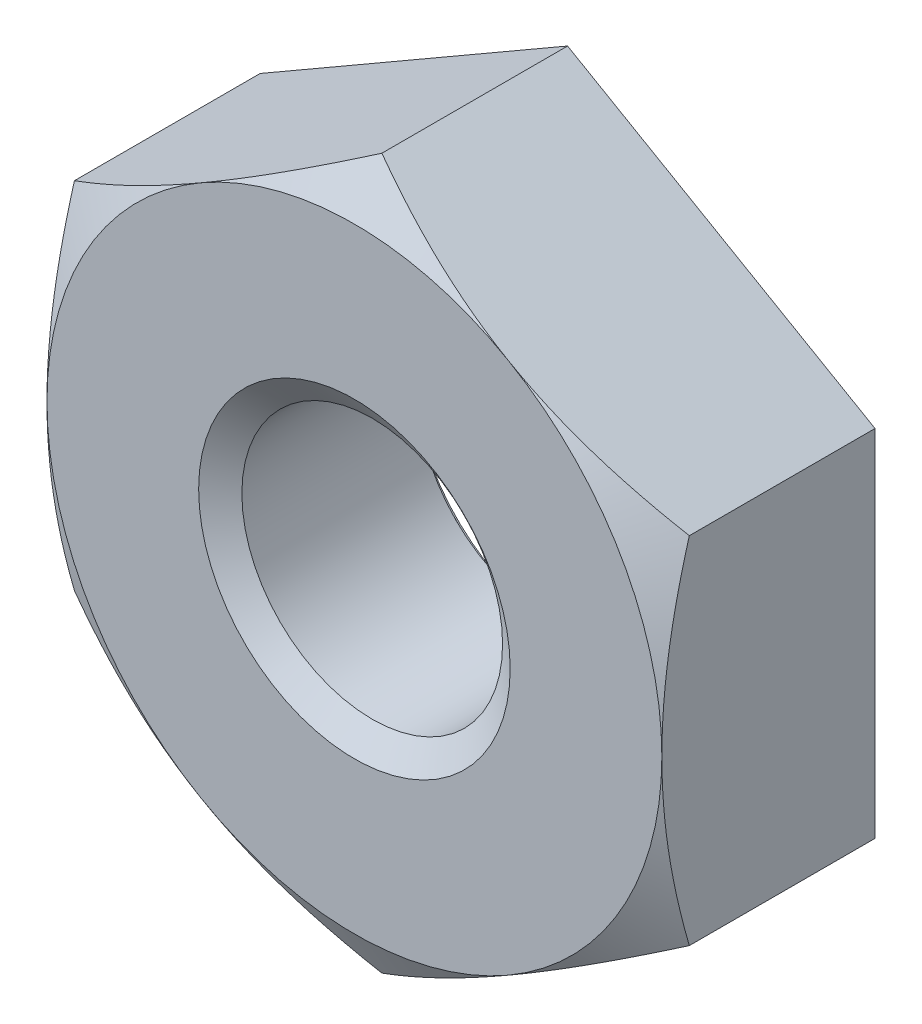
ISO-10303-21;
HEADER;
FILE_DESCRIPTION(('STEP AP214'),'2;1');
FILE_NAME('part.step','',(''),(''),'','','');
FILE_SCHEMA(('AUTOMOTIVE_DESIGN { 1 0 10303 214 1 1 1 1 }'));
ENDSEC;
DATA;
#1=APPLICATION_CONTEXT('core data for automotive mechanical design processes');
#2=APPLICATION_PROTOCOL_DEFINITION('international standard','automotive_design',2000,#1);
#3=PRODUCT_CONTEXT('',#1,'mechanical');
#4=PRODUCT('Part','Part','',(#3));
#5=PRODUCT_RELATED_PRODUCT_CATEGORY('part','',(#4));
#6=PRODUCT_DEFINITION_FORMATION('','',#4);
#7=PRODUCT_DEFINITION_CONTEXT('part definition',#1,'design');
#8=PRODUCT_DEFINITION('design','',#6,#7);
#9=PRODUCT_DEFINITION_SHAPE('','',#8);
#10=(LENGTH_UNIT() NAMED_UNIT(*) SI_UNIT(.MILLI.,.METRE.));
#11=(NAMED_UNIT(*) PLANE_ANGLE_UNIT() SI_UNIT($,.RADIAN.));
#12=(NAMED_UNIT(*) SI_UNIT($,.STERADIAN.) SOLID_ANGLE_UNIT());
#13=UNCERTAINTY_MEASURE_WITH_UNIT(LENGTH_MEASURE(1.E-05),#10,'distance_accuracy_value','');
#14=(GEOMETRIC_REPRESENTATION_CONTEXT(3) GLOBAL_UNCERTAINTY_ASSIGNED_CONTEXT((#13)) GLOBAL_UNIT_ASSIGNED_CONTEXT((#10,
#11,#12)) REPRESENTATION_CONTEXT('',''));
#15=CARTESIAN_POINT('',(0.,0.,0.));
#16=DIRECTION('',(0.,0.,1.));
#17=DIRECTION('',(1.,0.,0.));
#18=AXIS2_PLACEMENT_3D('',#15,#16,#17);
#19=CARTESIAN_POINT('',(0.,0.,-5.6843418860808E-11));
#20=DIRECTION('',(0.,0.,1.));
#21=DIRECTION('',(1.,0.,0.));
#22=AXIS2_PLACEMENT_3D('',#19,#20,#21);
#23=CONICAL_SURFACE('',#22,2.41299999993316,0.959931088654901);
#24=CARTESIAN_POINT('',(0.,0.,-0.275671707793163));
#25=DIRECTION('',(0.,0.,1.));
#26=DIRECTION('',(1.,0.,0.));
#27=AXIS2_PLACEMENT_3D('',#24,#25,#26);
#28=CIRCLE('',#27,2.0193);
#29=CARTESIAN_POINT('',(2.0193,0.,-0.275671707793163));
#30=VERTEX_POINT('',#29);
#31=EDGE_CURVE('E265',#30,#30,#28,.F.);
#32=ORIENTED_EDGE('',*,*,#31,.T.);
#33=EDGE_LOOP('',(#32));
#34=FACE_BOUND('',#33,.T.);
#35=CARTESIAN_POINT('',(0.,0.,-1.70412284817733E-11));
#36=DIRECTION('',(0.,0.,1.));
#37=DIRECTION('',(1.,0.,0.));
#38=AXIS2_PLACEMENT_3D('',#35,#36,#37);
#39=CIRCLE('',#38,2.41299999999001);
#40=CARTESIAN_POINT('',(2.41299999999001,0.,-1.70412284817733E-11));
#41=VERTEX_POINT('',#40);
#42=EDGE_CURVE('E19',#41,#41,#39,.T.);
#43=ORIENTED_EDGE('',*,*,#42,.T.);
#44=EDGE_LOOP('',(#43));
#45=FACE_BOUND('',#44,.T.);
#46=ADVANCED_FACE('F16',(#34,#45),#23,.F.);
#47=CARTESIAN_POINT('',(0.,0.,-3.302));
#48=DIRECTION('',(0.,0.,1.));
#49=DIRECTION('',(1.,0.,0.));
#50=AXIS2_PLACEMENT_3D('',#47,#48,#49);
#51=CYLINDRICAL_SURFACE('',#50,2.0193);
#52=ORIENTED_EDGE('',*,*,#31,.F.);
#53=EDGE_LOOP('',(#52));
#54=FACE_BOUND('',#53,.T.);
#55=CARTESIAN_POINT('',(0.,0.,-3.00092829218102));
#56=DIRECTION('',(0.,0.,-1.));
#57=DIRECTION('',(-1.,0.,0.));
#58=AXIS2_PLACEMENT_3D('',#55,#56,#57);
#59=CIRCLE('',#58,2.01929999997219);
#60=CARTESIAN_POINT('',(-2.01929999997219,0.,-3.00092829218102));
#61=VERTEX_POINT('',#60);
#62=EDGE_CURVE('E95',#61,#61,#59,.T.);
#63=ORIENTED_EDGE('',*,*,#62,.T.);
#64=EDGE_LOOP('',(#63));
#65=FACE_BOUND('',#64,.T.);
#66=ADVANCED_FACE('F274',(#54,#65),#51,.F.);
#67=CARTESIAN_POINT('',(0.,5.49926131403119,0.));
#68=DIRECTION('',(0.,0.,-1.));
#69=DIRECTION('',(-1.,0.,0.));
#70=AXIS2_PLACEMENT_3D('',#67,#68,#69);
#71=PLANE('',#70);
#72=CARTESIAN_POINT('',(0.,0.,-8.79380119070405E-12));
#73=DIRECTION('',(0.,0.,-1.));
#74=DIRECTION('',(-1.,0.,0.));
#75=AXIS2_PLACEMENT_3D('',#72,#73,#74);
#76=CIRCLE('',#75,4.76250000002665);
#77=CARTESIAN_POINT('',(-2.38125000000667,-4.12444598553493,-1.10351378561416E-12));
#78=VERTEX_POINT('',#77);
#79=CARTESIAN_POINT('',(-4.76250000001332,0.,-1.10119835431623E-12));
#80=VERTEX_POINT('',#79);
#81=EDGE_CURVE('E106',#78,#80,#76,.T.);
#82=ORIENTED_EDGE('',*,*,#81,.F.);
#83=CARTESIAN_POINT('',(0.,0.,-8.79380119070405E-12));
#84=DIRECTION('',(0.,0.,-1.));
#85=DIRECTION('',(-1.,0.,0.));
#86=AXIS2_PLACEMENT_3D('',#83,#84,#85);
#87=CIRCLE('',#86,4.76250000002665);
#88=CARTESIAN_POINT('',(2.38125000000667,-4.12444598553493,-1.10313595985333E-12));
#89=VERTEX_POINT('',#88);
#90=EDGE_CURVE('E302',#89,#78,#87,.T.);
#91=ORIENTED_EDGE('',*,*,#90,.F.);
#92=CARTESIAN_POINT('',(0.,0.,-8.79380119070405E-12));
#93=DIRECTION('',(0.,0.,-1.));
#94=DIRECTION('',(-1.,0.,0.));
#95=AXIS2_PLACEMENT_3D('',#92,#93,#94);
#96=CIRCLE('',#95,4.76250000002665);
#97=CARTESIAN_POINT('',(4.76250000001332,0.,-1.10120397550399E-12));
#98=VERTEX_POINT('',#97);
#99=EDGE_CURVE('E305',#98,#89,#96,.T.);
#100=ORIENTED_EDGE('',*,*,#99,.F.);
#101=CARTESIAN_POINT('',(0.,0.,-8.79428908168167E-12));
#102=DIRECTION('',(0.,0.,-1.));
#103=DIRECTION('',(-1.,0.,0.));
#104=AXIS2_PLACEMENT_3D('',#101,#102,#103);
#105=CIRCLE('',#104,4.76250000002665);
#106=CARTESIAN_POINT('',(2.38125000000667,4.12444598553493,-1.10163153120633E-12));
#107=VERTEX_POINT('',#106);
#108=EDGE_CURVE('E90',#107,#98,#105,.T.);
#109=ORIENTED_EDGE('',*,*,#108,.F.);
#110=CARTESIAN_POINT('',(0.,0.,-8.79380119070405E-12));
#111=DIRECTION('',(0.,0.,-1.));
#112=DIRECTION('',(-1.,0.,0.));
#113=AXIS2_PLACEMENT_3D('',#110,#111,#112);
#114=CIRCLE('',#113,4.76250000002665);
#115=CARTESIAN_POINT('',(-2.38125000000667,4.12444598553493,-1.10107701861357E-12));
#116=VERTEX_POINT('',#115);
#117=EDGE_CURVE('E83',#116,#107,#114,.T.);
#118=ORIENTED_EDGE('',*,*,#117,.F.);
#119=CARTESIAN_POINT('',(0.,0.,-8.79380119070405E-12));
#120=DIRECTION('',(0.,0.,-1.));
#121=DIRECTION('',(-1.,0.,0.));
#122=AXIS2_PLACEMENT_3D('',#119,#120,#121);
#123=CIRCLE('',#122,4.76250000002665);
#124=EDGE_CURVE('E87',#80,#116,#123,.T.);
#125=ORIENTED_EDGE('',*,*,#124,.F.);
#126=EDGE_LOOP('',(#82,#91,#100,#109,#118,#125));
#127=FACE_BOUND('',#126,.T.);
#128=ORIENTED_EDGE('',*,*,#42,.F.);
#129=EDGE_LOOP('',(#128));
#130=FACE_BOUND('',#129,.T.);
#131=ADVANCED_FACE('F85',(#127,#130),#71,.F.);
#132=CARTESIAN_POINT('',(0.,0.,-3.27659999999241));
#133=DIRECTION('',(0.,0.,-1.));
#134=DIRECTION('',(0.,1.,0.));
#135=AXIS2_PLACEMENT_3D('',#132,#133,#134);
#136=CONICAL_SURFACE('',#135,2.41299999999001,0.959931088587063);
#137=CARTESIAN_POINT('',(0.,0.,-3.2766));
#138=DIRECTION('',(0.,0.,1.));
#139=DIRECTION('',(1.,0.,0.));
#140=AXIS2_PLACEMENT_3D('',#137,#138,#139);
#141=CIRCLE('',#140,2.413);
#142=CARTESIAN_POINT('',(2.413,0.,-3.2766));
#143=VERTEX_POINT('',#142);
#144=EDGE_CURVE('E105',#143,#143,#141,.F.);
#145=ORIENTED_EDGE('',*,*,#144,.T.);
#146=EDGE_LOOP('',(#145));
#147=FACE_BOUND('',#146,.T.);
#148=ORIENTED_EDGE('',*,*,#62,.F.);
#149=EDGE_LOOP('',(#148));
#150=FACE_BOUND('',#149,.T.);
#151=ADVANCED_FACE('F273',(#147,#150),#136,.F.);
#152=CARTESIAN_POINT('',(0.,0.,-0.427921558923572));
#153=DIRECTION('',(0.,0.,-1.));
#154=DIRECTION('',(-1.,0.,0.));
#155=AXIS2_PLACEMENT_3D('',#152,#153,#154);
#156=CONICAL_SURFACE('',#155,5.50368188174843,1.04719755121255);
#157=CARTESIAN_POINT('',(-6.57470253429978E-12,5.49926131403023,-0.425369342966343));
#158=CARTESIAN_POINT('',(0.193832735404072,5.38735193206623,-0.360742221986517));
#159=CARTESIAN_POINT('',(0.389217753013979,5.27454633955475,-0.301532496062848));
#160=CARTESIAN_POINT('',(0.781710087846539,5.04794078438518,-0.197117210458148));
#161=CARTESIAN_POINT('',(0.978803714582613,4.93414872593319,-0.151842403220737));
#162=CARTESIAN_POINT('',(1.27630424018816,4.76238671739065,-0.096252626602181));
#163=CARTESIAN_POINT('',(1.37584688888363,4.7049157423705,-0.0797696918938054));
#164=CARTESIAN_POINT('',(1.57540873750926,4.58969865534654,-0.0512373883192666));
#165=CARTESIAN_POINT('',(1.67542792482634,4.53195255062488,-0.0391879027613516));
#166=CARTESIAN_POINT('',(1.87631280929093,4.41597160850312,-0.0197342067433639));
#167=CARTESIAN_POINT('',(1.97718023538533,4.35773577289506,-0.0123536194859315));
#168=CARTESIAN_POINT('',(2.1791134611326,4.24114957065155,-0.00247630041487323));
#169=CARTESIAN_POINT('',(2.28017929610706,4.18279918362317,1.94641666244899E-05));
#170=CARTESIAN_POINT('',(2.38125,4.12444598552339,6.59141863233587E-12));
#171=B_SPLINE_CURVE_WITH_KNOTS('',3,(#157,#158,#159,#160,#161,#162,#163,#164,#165,#166,#167,
#168,#169,#170),.UNSPECIFIED.,.F.,.F.,(4,2,2,2,2,2,4),(0.,0.699169917117899,1.39480712187711,
1.74308213497134,2.0913479805466,2.4413621403802,2.79144559867711),.UNSPECIFIED.);
#172=CARTESIAN_POINT('',(0.,5.49926131403416,-0.425369342963856));
#173=VERTEX_POINT('',#172);
#174=EDGE_CURVE('E111',#173,#107,#171,.T.);
#175=ORIENTED_EDGE('',*,*,#174,.F.);
#176=CARTESIAN_POINT('',(-2.38125000000001,4.12444598552339,6.59183494280176E-12));
#177=CARTESIAN_POINT('',(-2.28017929610708,4.18279918362315,1.94641666236029E-05));
#178=CARTESIAN_POINT('',(-2.17911346113265,4.24114957065152,-0.00247630041487208));
#179=CARTESIAN_POINT('',(-1.97718023538543,4.357735772895,-0.0123536194859243));
#180=CARTESIAN_POINT('',(-1.87631280929105,4.41597160850305,-0.0197342067433529));
#181=CARTESIAN_POINT('',(-1.67542792482649,4.5319525506248,-0.0391879027613369));
#182=CARTESIAN_POINT('',(-1.5754087375094,4.58969865534644,-0.0512373883192526));
#183=CARTESIAN_POINT('',(-1.37584688888381,4.70491574237041,-0.0797696918937728));
#184=CARTESIAN_POINT('',(-1.27630424018835,4.76238671739058,-0.096252626602129));
#185=CARTESIAN_POINT('',(-0.978803714582831,4.93414872593299,-0.151842403220728));
#186=CARTESIAN_POINT('',(-0.781710087846699,5.04794078438465,-0.197117210458306));
#187=CARTESIAN_POINT('',(-0.389217753014537,5.27454633955487,-0.301532496062498));
#188=CARTESIAN_POINT('',(-0.193832735405087,5.3873519320673,-0.360742221985488));
#189=CARTESIAN_POINT('',(4.51563863074283E-12,5.4992613140338,-0.425369342963649));
#190=B_SPLINE_CURVE_WITH_KNOTS('',3,(#176,#177,#178,#179,#180,#181,#182,#183,#184,#185,#186,
#187,#188,#189),.UNSPECIFIED.,.F.,.F.,(4,2,2,2,2,2,4),(0.,0.350083458296829,0.700097618130358,
1.04836346370559,1.39663847679978,2.0922756815588,2.79144559867643),.UNSPECIFIED.);
#191=EDGE_CURVE('E108',#116,#173,#190,.T.);
#192=ORIENTED_EDGE('',*,*,#191,.F.);
#193=ORIENTED_EDGE('',*,*,#117,.T.);
#194=EDGE_LOOP('',(#175,#192,#193));
#195=FACE_BOUND('',#194,.T.);
#196=ADVANCED_FACE('F109',(#195),#156,.T.);
#197=CARTESIAN_POINT('',(0.,0.,-0.427921558923572));
#198=DIRECTION('',(0.,0.,-1.));
#199=DIRECTION('',(-1.,0.,0.));
#200=AXIS2_PLACEMENT_3D('',#197,#198,#199);
#201=CONICAL_SURFACE('',#200,5.50368188174843,1.04719755121255);
#202=CARTESIAN_POINT('',(4.7625,0.,6.59140609214101E-12));
#203=CARTESIAN_POINT('',(4.7625,0.11670639619956,1.94641666233768E-05));
#204=CARTESIAN_POINT('',(4.7625,0.233407170256322,-0.00247630041487358));
#205=CARTESIAN_POINT('',(4.7625,0.466579574743357,-0.0123536194859311));
#206=CARTESIAN_POINT('',(4.7625,0.583051245959492,-0.0197342067433638));
#207=CARTESIAN_POINT('',(4.7625,0.815013130203041,-0.0391879027613582));
#208=CARTESIAN_POINT('',(4.7625,0.930505339646364,-0.0512373883192804));
#209=CARTESIAN_POINT('',(4.7625,1.16093951369436,-0.0797696918938151));
#210=CARTESIAN_POINT('',(4.7625,1.27588146373473,-0.0962526266021794));
#211=CARTESIAN_POINT('',(4.7625,1.61940548081962,-0.151842403220806));
#212=CARTESIAN_POINT('',(4.7625,1.84698959772301,-0.197117210458406));
#213=CARTESIAN_POINT('',(4.7625,2.30020070806355,-0.301532496062648));
#214=CARTESIAN_POINT('',(4.7625,2.52581189308848,-0.360742221985667));
#215=CARTESIAN_POINT('',(4.7625,2.74963065702153,-0.425369342963855));
#216=B_SPLINE_CURVE_WITH_KNOTS('',3,(#202,#203,#204,#205,#206,#207,#208,#209,#210,#211,#212,
#213,#214,#215),.UNSPECIFIED.,.F.,.F.,(4,2,2,2,2,2,4),(0.,0.350083458296922,0.700097618130546,
1.04836346370587,1.39663847680015,2.09227568155936,2.79144559867718),.UNSPECIFIED.);
#217=CARTESIAN_POINT('',(4.76250000000257,2.74963065701708,-0.425369342963854));
#218=VERTEX_POINT('',#217);
#219=EDGE_CURVE('E232',#98,#218,#216,.T.);
#220=ORIENTED_EDGE('',*,*,#219,.T.);
#221=CARTESIAN_POINT('',(2.38125,4.12444598552339,6.59115121215225E-12));
#222=CARTESIAN_POINT('',(2.48232070389293,4.06609278742362,1.94641666232737E-05));
#223=CARTESIAN_POINT('',(2.58338653886736,4.00774240039526,-0.00247630041487226));
#224=CARTESIAN_POINT('',(2.78531976461458,3.89115619815177,-0.0123536194859244));
#225=CARTESIAN_POINT('',(2.88618719070896,3.83292036254372,-0.019734206743353));
#226=CARTESIAN_POINT('',(3.08707207517352,3.71693942042198,-0.039187902761337));
#227=CARTESIAN_POINT('',(3.1870912624906,3.65919331570033,-0.0512373883192526));
#228=CARTESIAN_POINT('',(3.3866531111162,3.54397622867636,-0.0797696918937724));
#229=CARTESIAN_POINT('',(3.48619575981165,3.4865052536562,-0.0962526266021281));
#230=CARTESIAN_POINT('',(3.78369628541717,3.31474324511379,-0.151842403220726));
#231=CARTESIAN_POINT('',(3.9807899121533,3.20095118666213,-0.197117210458304));
#232=CARTESIAN_POINT('',(4.37328224698546,2.97434563149192,-0.301532496062495));
#233=CARTESIAN_POINT('',(4.56866726459491,2.86154003897948,-0.360742221985485));
#234=CARTESIAN_POINT('',(4.76250000000451,2.74963065701298,-0.425369342963645));
#235=B_SPLINE_CURVE_WITH_KNOTS('',3,(#221,#222,#223,#224,#225,#226,#227,#228,#229,#230,#231,
#232,#233,#234),.UNSPECIFIED.,.F.,.F.,(4,2,2,2,2,2,4),(0.,0.350083458296827,0.700097618130355,
1.04836346370559,1.39663847679977,2.09227568155879,2.79144559867642),.UNSPECIFIED.);
#236=EDGE_CURVE('E321',#107,#218,#235,.T.);
#237=ORIENTED_EDGE('',*,*,#236,.F.);
#238=ORIENTED_EDGE('',*,*,#108,.T.);
#239=EDGE_LOOP('',(#220,#237,#238));
#240=FACE_BOUND('',#239,.T.);
#241=ADVANCED_FACE('F202',(#240),#201,.T.);
#242=CARTESIAN_POINT('',(0.,0.,-0.427921558923572));
#243=DIRECTION('',(0.,0.,-1.));
#244=DIRECTION('',(-1.,0.,0.));
#245=AXIS2_PLACEMENT_3D('',#242,#243,#244);
#246=CONICAL_SURFACE('',#245,5.50368188174843,1.04719755121255);
#247=ORIENTED_EDGE('',*,*,#99,.T.);
#248=CARTESIAN_POINT('',(4.76250000000246,-2.74963065700942,-0.425369342966343));
#249=CARTESIAN_POINT('',(4.56866726459449,-2.86154003897807,-0.360742221986517));
#250=CARTESIAN_POINT('',(4.37328224698565,-2.97434563149138,-0.301532496062848));
#251=CARTESIAN_POINT('',(3.98078991215384,-3.20095118666226,-0.19711721045815));
#252=CARTESIAN_POINT('',(3.78369628541746,-3.31474324511371,-0.151842403220739));
#253=CARTESIAN_POINT('',(3.48619575981181,-3.48650525365607,-0.0962526266021836));
#254=CARTESIAN_POINT('',(3.38665311111636,-3.54397622867626,-0.0797696918938082));
#255=CARTESIAN_POINT('',(3.18709126249076,-3.65919331570026,-0.0512373883192697));
#256=CARTESIAN_POINT('',(3.08707207517367,-3.7169394204219,-0.0391879027613548));
#257=CARTESIAN_POINT('',(2.88618719070907,-3.83292036254366,-0.0197342067433674));
#258=CARTESIAN_POINT('',(2.78531976461468,-3.89115619815172,-0.0123536194859352));
#259=CARTESIAN_POINT('',(2.58338653886742,-4.00774240039524,-0.00247630041487713));
#260=CARTESIAN_POINT('',(2.48232070389296,-4.06609278742362,1.94641666205294E-05));
#261=CARTESIAN_POINT('',(2.38125000000001,-4.12444598552339,6.58755298218894E-12));
#262=B_SPLINE_CURVE_WITH_KNOTS('',3,(#248,#249,#250,#251,#252,#253,#254,#255,#256,#257,#258,
#259,#260,#261),.UNSPECIFIED.,.F.,.F.,(4,2,2,2,2,2,4),(0.,0.699169917117896,1.39480712187711,
1.74308213497133,2.09134798054659,2.44136214038018,2.7914455986771),.UNSPECIFIED.);
#263=CARTESIAN_POINT('',(4.76250000000257,-2.74963065701708,-0.425369342963856));
#264=VERTEX_POINT('',#263);
#265=EDGE_CURVE('E212',#264,#89,#262,.T.);
#266=ORIENTED_EDGE('',*,*,#265,.F.);
#267=CARTESIAN_POINT('',(4.7625,-2.74963065702153,-0.425369342963855));
#268=CARTESIAN_POINT('',(4.7625,-2.52581189308848,-0.360742221985666));
#269=CARTESIAN_POINT('',(4.7625,-2.30020070806355,-0.301532496062648));
#270=CARTESIAN_POINT('',(4.7625,-1.84698959772301,-0.197117210458406));
#271=CARTESIAN_POINT('',(4.7625,-1.61940548081962,-0.151842403220806));
#272=CARTESIAN_POINT('',(4.7625,-1.27588146373473,-0.0962526266021792));
#273=CARTESIAN_POINT('',(4.7625,-1.16093951369436,-0.0797696918938147));
#274=CARTESIAN_POINT('',(4.7625,-0.930505339646363,-0.0512373883192797));
#275=CARTESIAN_POINT('',(4.7625,-0.81501313020304,-0.0391879027613576));
#276=CARTESIAN_POINT('',(4.7625,-0.583051245959492,-0.0197342067433634));
#277=CARTESIAN_POINT('',(4.7625,-0.466579574743356,-0.0123536194859309));
#278=CARTESIAN_POINT('',(4.7625,-0.233407170256321,-0.00247630041487366));
#279=CARTESIAN_POINT('',(4.7625,-0.116706396199559,1.94641666232199E-05));
#280=CARTESIAN_POINT('',(4.7625,0.,6.59139323969608E-12));
#281=B_SPLINE_CURVE_WITH_KNOTS('',3,(#267,#268,#269,#270,#271,#272,#273,#274,#275,#276,#277,
#278,#279,#280),.UNSPECIFIED.,.F.,.F.,(4,2,2,2,2,2,4),(0.,0.699169917117818,1.39480712187703,
1.7430821349713,2.09134798054663,2.44136214038025,2.79144559867718),.UNSPECIFIED.);
#282=EDGE_CURVE('E207',#264,#98,#281,.T.);
#283=ORIENTED_EDGE('',*,*,#282,.T.);
#284=EDGE_LOOP('',(#247,#266,#283));
#285=FACE_BOUND('',#284,.T.);
#286=ADVANCED_FACE('F196',(#285),#246,.T.);
#287=CARTESIAN_POINT('',(0.,0.,-0.427921558923572));
#288=DIRECTION('',(0.,0.,-1.));
#289=DIRECTION('',(-1.,0.,0.));
#290=AXIS2_PLACEMENT_3D('',#287,#288,#289);
#291=CONICAL_SURFACE('',#290,5.50368188174843,1.04719755121255);
#292=CARTESIAN_POINT('',(6.56533729484594E-12,-5.49926131403024,-0.425369342966344));
#293=CARTESIAN_POINT('',(-0.19383273540408,-5.38735193206623,-0.360742221986518));
#294=CARTESIAN_POINT('',(-0.389217753013987,-5.27454633955476,-0.30153249606285));
#295=CARTESIAN_POINT('',(-0.781710087846545,-5.04794078438518,-0.197117210458151));
#296=CARTESIAN_POINT('',(-0.978803714582619,-4.93414872593319,-0.15184240322074));
#297=CARTESIAN_POINT('',(-1.27630424018817,-4.76238671739066,-0.096252626602185));
#298=CARTESIAN_POINT('',(-1.37584688888364,-4.70491574237051,-0.0797696918938096));
#299=CARTESIAN_POINT('',(-1.57540873750926,-4.58969865534655,-0.051237388319271));
#300=CARTESIAN_POINT('',(-1.67542792482635,-4.53195255062489,-0.039187902761356));
#301=CARTESIAN_POINT('',(-1.87631280929094,-4.41597160850313,-0.0197342067433682));
#302=CARTESIAN_POINT('',(-1.97718023538533,-4.35773577289506,-0.0123536194859356));
#303=CARTESIAN_POINT('',(-2.1791134611326,-4.24114957065155,-0.00247630041487741));
#304=CARTESIAN_POINT('',(-2.28017929610706,-4.18279918362318,1.94641666201247E-05));
#305=CARTESIAN_POINT('',(-2.38125000000001,-4.1244459855234,6.58655208146622E-12));
#306=B_SPLINE_CURVE_WITH_KNOTS('',3,(#292,#293,#294,#295,#296,#297,#298,#299,#300,#301,#302,
#303,#304,#305),.UNSPECIFIED.,.F.,.F.,(4,2,2,2,2,2,4),(0.,0.699169917117897,1.39480712187711,
1.74308213497133,2.09134798054659,2.44136214038019,2.7914455986771),.UNSPECIFIED.);
#307=CARTESIAN_POINT('',(0.,-5.49926131403416,-0.42536934296386));
#308=VERTEX_POINT('',#307);
#309=EDGE_CURVE('E180',#308,#78,#306,.T.);
#310=ORIENTED_EDGE('',*,*,#309,.F.);
#311=CARTESIAN_POINT('',(2.38125000000001,-4.12444598552339,6.58752927099739E-12));
#312=CARTESIAN_POINT('',(2.28017929610709,-4.18279918362316,1.94641666191547E-05));
#313=CARTESIAN_POINT('',(2.17911346113265,-4.24114957065152,-0.00247630041487648));
#314=CARTESIAN_POINT('',(1.97718023538543,-4.35773577289501,-0.0123536194859286));
#315=CARTESIAN_POINT('',(1.87631280929105,-4.41597160850306,-0.0197342067433571));
#316=CARTESIAN_POINT('',(1.67542792482649,-4.53195255062481,-0.0391879027613412));
#317=CARTESIAN_POINT('',(1.5754087375094,-4.58969865534645,-0.0512373883192571));
#318=CARTESIAN_POINT('',(1.37584688888381,-4.70491574237042,-0.0797696918937774));
#319=CARTESIAN_POINT('',(1.27630424018835,-4.76238671739059,-0.0962526266021335));
#320=CARTESIAN_POINT('',(0.97880371458283,-4.93414872593299,-0.151842403220732));
#321=CARTESIAN_POINT('',(0.781710087846697,-5.04794078438466,-0.19711721045831));
#322=CARTESIAN_POINT('',(0.389217753014534,-5.27454633955487,-0.301532496062503));
#323=CARTESIAN_POINT('',(0.193832735405084,-5.38735193206731,-0.360742221985494));
#324=CARTESIAN_POINT('',(-4.52012801688809E-12,-5.49926131403381,-0.425369342963655));
#325=B_SPLINE_CURVE_WITH_KNOTS('',3,(#311,#312,#313,#314,#315,#316,#317,#318,#319,#320,#321,
#322,#323,#324),.UNSPECIFIED.,.F.,.F.,(4,2,2,2,2,2,4),(0.,0.350083458296829,0.70009761813036,
1.04836346370559,1.39663847679978,2.09227568155881,2.79144559867644),.UNSPECIFIED.);
#326=EDGE_CURVE('E187',#89,#308,#325,.T.);
#327=ORIENTED_EDGE('',*,*,#326,.F.);
#328=ORIENTED_EDGE('',*,*,#90,.T.);
#329=EDGE_LOOP('',(#310,#327,#328));
#330=FACE_BOUND('',#329,.T.);
#331=ADVANCED_FACE('F192',(#330),#291,.T.);
#332=CARTESIAN_POINT('',(0.,0.,-0.427921558923572));
#333=DIRECTION('',(0.,0.,-1.));
#334=DIRECTION('',(-1.,0.,0.));
#335=AXIS2_PLACEMENT_3D('',#332,#333,#334);
#336=CONICAL_SURFACE('',#335,5.50368188174843,1.04719755121255);
#337=CARTESIAN_POINT('',(-4.76249999999588,-2.74963065702082,-0.425369342966343));
#338=CARTESIAN_POINT('',(-4.76249999999856,-2.52581189308817,-0.360742221986517));
#339=CARTESIAN_POINT('',(-4.76249999999962,-2.30020070806338,-0.301532496062847));
#340=CARTESIAN_POINT('',(-4.76250000000037,-1.84698959772292,-0.197117210458148));
#341=CARTESIAN_POINT('',(-4.76250000000007,-1.61940548081948,-0.151842403220736));
#342=CARTESIAN_POINT('',(-4.76249999999997,-1.27588146373459,-0.0962526266021805));
#343=CARTESIAN_POINT('',(-4.76249999999999,-1.16093951369424,-0.079769691893805));
#344=CARTESIAN_POINT('',(-4.76250000000001,-0.93050533964629,-0.0512373883192663));
#345=CARTESIAN_POINT('',(-4.7625,-0.815013130202988,-0.0391879027613513));
#346=CARTESIAN_POINT('',(-4.7625,-0.583051245959469,-0.0197342067433635));
#347=CARTESIAN_POINT('',(-4.7625,-0.466579574743341,-0.0123536194859309));
#348=CARTESIAN_POINT('',(-4.7625,-0.233407170256317,-0.00247630041487258));
#349=CARTESIAN_POINT('',(-4.7625,-0.116706396199557,1.94641666250039E-05));
#350=CARTESIAN_POINT('',(-4.7625,0.,6.59141420376152E-12));
#351=B_SPLINE_CURVE_WITH_KNOTS('',3,(#337,#338,#339,#340,#341,#342,#343,#344,#345,#346,#347,
#348,#349,#350),.UNSPECIFIED.,.F.,.F.,(4,2,2,2,2,2,4),(0.,0.699169917117899,1.39480712187711,
1.74308213497134,2.0913479805466,2.4413621403802,2.79144559867711),.UNSPECIFIED.);
#352=CARTESIAN_POINT('',(-4.76250000000257,-2.74963065701708,-0.425369342963856));
#353=VERTEX_POINT('',#352);
#354=EDGE_CURVE('E152',#353,#80,#351,.T.);
#355=ORIENTED_EDGE('',*,*,#354,.F.);
#356=CARTESIAN_POINT('',(-2.38125000000001,-4.1244459855234,6.58664842659251E-12));
#357=CARTESIAN_POINT('',(-2.48232070389293,-4.06609278742363,1.94641666184794E-05));
#358=CARTESIAN_POINT('',(-2.58338653886736,-4.00774240039527,-0.0024763004148771));
#359=CARTESIAN_POINT('',(-2.78531976461458,-3.89115619815178,-0.0123536194859291));
#360=CARTESIAN_POINT('',(-2.88618719070896,-3.83292036254373,-0.0197342067433576));
#361=CARTESIAN_POINT('',(-3.08707207517352,-3.71693942042199,-0.0391879027613412));
#362=CARTESIAN_POINT('',(-3.18709126249061,-3.65919331570034,-0.0512373883192567));
#363=CARTESIAN_POINT('',(-3.3866531111162,-3.54397622867637,-0.0797696918937766));
#364=CARTESIAN_POINT('',(-3.48619575981165,-3.4865052536562,-0.0962526266021326));
#365=CARTESIAN_POINT('',(-3.78369628541717,-3.3147432451138,-0.151842403220731));
#366=CARTESIAN_POINT('',(-3.9807899121533,-3.20095118666214,-0.197117210458308));
#367=CARTESIAN_POINT('',(-4.37328224698546,-2.97434563149192,-0.301532496062499));
#368=CARTESIAN_POINT('',(-4.56866726459491,-2.86154003897949,-0.360742221985489));
#369=CARTESIAN_POINT('',(-4.76250000000452,-2.74963065701299,-0.425369342963649));
#370=B_SPLINE_CURVE_WITH_KNOTS('',3,(#356,#357,#358,#359,#360,#361,#362,#363,#364,#365,#366,
#367,#368,#369),.UNSPECIFIED.,.F.,.F.,(4,2,2,2,2,2,4),(0.,0.350083458296827,0.700097618130355,
1.04836346370559,1.39663847679977,2.09227568155879,2.79144559867642),.UNSPECIFIED.);
#371=EDGE_CURVE('E175',#78,#353,#370,.T.);
#372=ORIENTED_EDGE('',*,*,#371,.F.);
#373=ORIENTED_EDGE('',*,*,#81,.T.);
#374=EDGE_LOOP('',(#355,#372,#373));
#375=FACE_BOUND('',#374,.T.);
#376=ADVANCED_FACE('F141',(#375),#336,.T.);
#377=CARTESIAN_POINT('',(0.,0.,-0.427921558923572));
#378=DIRECTION('',(0.,0.,-1.));
#379=DIRECTION('',(-1.,0.,0.));
#380=AXIS2_PLACEMENT_3D('',#377,#378,#379);
#381=CONICAL_SURFACE('',#380,5.50368188174843,1.04719755121255);
#382=ORIENTED_EDGE('',*,*,#124,.T.);
#383=CARTESIAN_POINT('',(-4.76250000000246,2.74963065700942,-0.425369342966341));
#384=CARTESIAN_POINT('',(-4.56866726459449,2.86154003897806,-0.360742221986515));
#385=CARTESIAN_POINT('',(-4.37328224698565,2.97434563149137,-0.301532496062845));
#386=CARTESIAN_POINT('',(-3.98078991215384,3.20095118666225,-0.197117210458146));
#387=CARTESIAN_POINT('',(-3.78369628541746,3.3147432451137,-0.151842403220735));
#388=CARTESIAN_POINT('',(-3.48619575981181,3.48650525365606,-0.0962526266021794));
#389=CARTESIAN_POINT('',(-3.38665311111636,3.54397622867626,-0.0797696918938041));
#390=CARTESIAN_POINT('',(-3.18709126249076,3.65919331570025,-0.0512373883192658));
#391=CARTESIAN_POINT('',(-3.08707207517367,3.71693942042189,-0.0391879027613511));
#392=CARTESIAN_POINT('',(-2.88618719070907,3.83292036254365,-0.0197342067433637));
#393=CARTESIAN_POINT('',(-2.78531976461468,3.89115619815171,-0.0123536194859311));
#394=CARTESIAN_POINT('',(-2.58338653886742,4.00774240039523,-0.00247630041487259));
#395=CARTESIAN_POINT('',(-2.48232070389296,4.06609278742361,1.94641666252099E-05));
#396=CARTESIAN_POINT('',(-2.38125000000001,4.12444598552339,6.59193168231252E-12));
#397=B_SPLINE_CURVE_WITH_KNOTS('',3,(#383,#384,#385,#386,#387,#388,#389,#390,#391,#392,#393,
#394,#395,#396),.UNSPECIFIED.,.F.,.F.,(4,2,2,2,2,2,4),(0.,0.699169917117897,1.39480712187711,
1.74308213497133,2.09134798054659,2.44136214038018,2.7914455986771),.UNSPECIFIED.);
#398=CARTESIAN_POINT('',(-4.76250000000257,2.7496306570141,-0.425369342962997));
#399=VERTEX_POINT('',#398);
#400=EDGE_CURVE('E100',#399,#116,#397,.T.);
#401=ORIENTED_EDGE('',*,*,#400,.F.);
#402=CARTESIAN_POINT('',(-4.7625,0.,6.5914044820716E-12));
#403=CARTESIAN_POINT('',(-4.7625,0.116706396199527,1.94641666232646E-05));
#404=CARTESIAN_POINT('',(-4.7625,0.233407170256258,-0.00247630041487231));
#405=CARTESIAN_POINT('',(-4.7625,0.46657957474323,-0.0123536194859244));
#406=CARTESIAN_POINT('',(-4.7625,0.583051245959334,-0.019734206743353));
#407=CARTESIAN_POINT('',(-4.7625,0.81501313020282,-0.039187902761337));
#408=CARTESIAN_POINT('',(-4.7625,0.930505339646112,-0.0512373883192528));
#409=CARTESIAN_POINT('',(-4.7625,1.16093951369405,-0.0797696918937726));
#410=CARTESIAN_POINT('',(-4.7625,1.27588146373438,-0.0962526266021283));
#411=CARTESIAN_POINT('',(-4.7625,1.61940548081919,-0.151842403220726));
#412=CARTESIAN_POINT('',(-4.7625,1.84698959772252,-0.197117210458304));
#413=CARTESIAN_POINT('',(-4.7625,2.30020070806294,-0.301532496062496));
#414=CARTESIAN_POINT('',(-4.7625,2.52581189308781,-0.360742221985486));
#415=CARTESIAN_POINT('',(-4.7625,2.7496306570208,-0.425369342963646));
#416=B_SPLINE_CURVE_WITH_KNOTS('',3,(#402,#403,#404,#405,#406,#407,#408,#409,#410,#411,#412,
#413,#414,#415),.UNSPECIFIED.,.F.,.F.,(4,2,2,2,2,2,4),(0.,0.350083458296827,0.700097618130355,
1.04836346370559,1.39663847679977,2.09227568155879,2.79144559867642),.UNSPECIFIED.);
#417=EDGE_CURVE('E103',#80,#399,#416,.T.);
#418=ORIENTED_EDGE('',*,*,#417,.F.);
#419=EDGE_LOOP('',(#382,#401,#418));
#420=FACE_BOUND('',#419,.T.);
#421=ADVANCED_FACE('F98',(#420),#381,.T.);
#422=CARTESIAN_POINT('',(0.,0.,-25.0375057290932));
#423=DIRECTION('',(0.,0.,1.));
#424=DIRECTION('',(1.,0.,0.));
#425=AXIS2_PLACEMENT_3D('',#422,#423,#424);
#426=CYLINDRICAL_SURFACE('',#425,2.413);
#427=ORIENTED_EDGE('',*,*,#144,.F.);
#428=EDGE_LOOP('',(#427));
#429=FACE_BOUND('',#428,.T.);
#430=CARTESIAN_POINT('',(0.,0.,-3.302));
#431=DIRECTION('',(0.,0.,1.));
#432=DIRECTION('',(1.,0.,0.));
#433=AXIS2_PLACEMENT_3D('',#430,#431,#432);
#434=CIRCLE('',#433,2.413);
#435=CARTESIAN_POINT('',(2.413,0.,-3.302));
#436=VERTEX_POINT('',#435);
#437=EDGE_CURVE('E153',#436,#436,#434,.T.);
#438=ORIENTED_EDGE('',*,*,#437,.F.);
#439=EDGE_LOOP('',(#438));
#440=FACE_BOUND('',#439,.T.);
#441=ADVANCED_FACE('F140',(#429,#440),#426,.F.);
#442=CARTESIAN_POINT('',(0.,5.49926131403119,-3.302));
#443=DIRECTION('',(-0.500000000000001,0.866025403784438,0.));
#444=DIRECTION('',(-0.866025403784438,-0.500000000000001,0.));
#445=AXIS2_PLACEMENT_3D('',#442,#443,#444);
#446=PLANE('',#445);
#447=DIRECTION('',(0.,0.,1.));
#448=VECTOR('',#447,1.);
#449=CARTESIAN_POINT('',(0.,5.49926131403119,-3.302));
#450=LINE('',#449,#448);
#451=CARTESIAN_POINT('',(0.,5.49926131403119,-3.302));
#452=VERTEX_POINT('',#451);
#453=EDGE_CURVE('E114',#452,#173,#450,.T.);
#454=ORIENTED_EDGE('',*,*,#453,.F.);
#455=DIRECTION('',(0.866025403784438,0.500000000000001,0.));
#456=VECTOR('',#455,1.);
#457=CARTESIAN_POINT('',(-4.7625,2.74963065701559,-3.302));
#458=LINE('',#457,#456);
#459=CARTESIAN_POINT('',(-4.7625,2.74963065701559,-3.302));
#460=VERTEX_POINT('',#459);
#461=EDGE_CURVE('E238',#460,#452,#458,.T.);
#462=ORIENTED_EDGE('',*,*,#461,.F.);
#463=DIRECTION('',(0.,0.,1.));
#464=VECTOR('',#463,1.);
#465=CARTESIAN_POINT('',(-4.7625,2.74963065701559,-3.302));
#466=LINE('',#465,#464);
#467=EDGE_CURVE('E119',#399,#460,#466,.F.);
#468=ORIENTED_EDGE('',*,*,#467,.F.);
#469=ORIENTED_EDGE('',*,*,#400,.T.);
#470=ORIENTED_EDGE('',*,*,#191,.T.);
#471=EDGE_LOOP('',(#454,#462,#468,#469,#470));
#472=FACE_BOUND('',#471,.T.);
#473=ADVANCED_FACE('F116',(#472),#446,.T.);
#474=CARTESIAN_POINT('',(4.7625,2.74963065701559,-3.302));
#475=DIRECTION('',(0.500000000000001,0.866025403784438,0.));
#476=DIRECTION('',(-0.866025403784438,0.500000000000001,0.));
#477=AXIS2_PLACEMENT_3D('',#474,#475,#476);
#478=PLANE('',#477);
#479=DIRECTION('',(0.,0.,1.));
#480=VECTOR('',#479,1.);
#481=CARTESIAN_POINT('',(4.7625,2.7496306570156,-3.302));
#482=LINE('',#481,#480);
#483=CARTESIAN_POINT('',(4.7625,2.7496306570156,-3.302));
#484=VERTEX_POINT('',#483);
#485=EDGE_CURVE('E224',#218,#484,#482,.F.);
#486=ORIENTED_EDGE('',*,*,#485,.T.);
#487=DIRECTION('',(0.866025403784438,-0.500000000000001,0.));
#488=VECTOR('',#487,1.);
#489=CARTESIAN_POINT('',(0.,5.49926131403119,-3.302));
#490=LINE('',#489,#488);
#491=EDGE_CURVE('E241',#452,#484,#490,.T.);
#492=ORIENTED_EDGE('',*,*,#491,.F.);
#493=ORIENTED_EDGE('',*,*,#453,.T.);
#494=ORIENTED_EDGE('',*,*,#174,.T.);
#495=ORIENTED_EDGE('',*,*,#236,.T.);
#496=EDGE_LOOP('',(#486,#492,#493,#494,#495));
#497=FACE_BOUND('',#496,.T.);
#498=ADVANCED_FACE('F311',(#497),#478,.T.);
#499=CARTESIAN_POINT('',(4.7625,2.74963065701559,-3.302));
#500=DIRECTION('',(-1.,0.,0.));
#501=DIRECTION('',(0.,0.,1.));
#502=AXIS2_PLACEMENT_3D('',#499,#500,#501);
#503=PLANE('',#502);
#504=DIRECTION('',(0.,0.,1.));
#505=VECTOR('',#504,1.);
#506=CARTESIAN_POINT('',(4.7625,-2.7496306570156,-3.302));
#507=LINE('',#506,#505);
#508=CARTESIAN_POINT('',(4.7625,-2.7496306570156,-3.302));
#509=VERTEX_POINT('',#508);
#510=EDGE_CURVE('E217',#509,#264,#507,.T.);
#511=ORIENTED_EDGE('',*,*,#510,.F.);
#512=DIRECTION('',(0.,1.,0.));
#513=VECTOR('',#512,1.);
#514=CARTESIAN_POINT('',(4.7625,5.49926131403119,-3.302));
#515=LINE('',#514,#513);
#516=EDGE_CURVE('E253',#484,#509,#515,.F.);
#517=ORIENTED_EDGE('',*,*,#516,.F.);
#518=ORIENTED_EDGE('',*,*,#485,.F.);
#519=ORIENTED_EDGE('',*,*,#219,.F.);
#520=ORIENTED_EDGE('',*,*,#282,.F.);
#521=EDGE_LOOP('',(#511,#517,#518,#519,#520));
#522=FACE_BOUND('',#521,.T.);
#523=ADVANCED_FACE('F316',(#522),#503,.F.);
#524=CARTESIAN_POINT('',(0.,-5.4992613140312,-3.302));
#525=DIRECTION('',(0.500000000000001,-0.866025403784438,0.));
#526=DIRECTION('',(0.866025403784438,0.500000000000001,0.));
#527=AXIS2_PLACEMENT_3D('',#524,#525,#526);
#528=PLANE('',#527);
#529=DIRECTION('',(0.,0.,1.));
#530=VECTOR('',#529,1.);
#531=CARTESIAN_POINT('',(0.,-5.4992613140312,-3.302));
#532=LINE('',#531,#530);
#533=CARTESIAN_POINT('',(0.,-5.4992613140312,-3.302));
#534=VERTEX_POINT('',#533);
#535=EDGE_CURVE('E186',#534,#308,#532,.T.);
#536=ORIENTED_EDGE('',*,*,#535,.F.);
#537=DIRECTION('',(-0.866025403784438,-0.500000000000001,0.));
#538=VECTOR('',#537,1.);
#539=CARTESIAN_POINT('',(4.7625,-2.7496306570156,-3.302));
#540=LINE('',#539,#538);
#541=EDGE_CURVE('E248',#509,#534,#540,.T.);
#542=ORIENTED_EDGE('',*,*,#541,.F.);
#543=ORIENTED_EDGE('',*,*,#510,.T.);
#544=ORIENTED_EDGE('',*,*,#265,.T.);
#545=ORIENTED_EDGE('',*,*,#326,.T.);
#546=EDGE_LOOP('',(#536,#542,#543,#544,#545));
#547=FACE_BOUND('',#546,.T.);
#548=ADVANCED_FACE('F171',(#547),#528,.T.);
#549=CARTESIAN_POINT('',(-4.7625,-2.7496306570156,-3.302));
#550=DIRECTION('',(-0.500000000000001,-0.866025403784438,0.));
#551=DIRECTION('',(0.866025403784438,-0.500000000000001,0.));
#552=AXIS2_PLACEMENT_3D('',#549,#550,#551);
#553=PLANE('',#552);
#554=DIRECTION('',(0.,0.,1.));
#555=VECTOR('',#554,1.);
#556=CARTESIAN_POINT('',(-4.7625,-2.7496306570156,-3.302));
#557=LINE('',#556,#555);
#558=CARTESIAN_POINT('',(-4.7625,-2.7496306570156,-3.302));
#559=VERTEX_POINT('',#558);
#560=EDGE_CURVE('E34',#559,#353,#557,.T.);
#561=ORIENTED_EDGE('',*,*,#560,.F.);
#562=DIRECTION('',(-0.866025403784438,0.500000000000001,0.));
#563=VECTOR('',#562,1.);
#564=CARTESIAN_POINT('',(0.,-5.4992613140312,-3.302));
#565=LINE('',#564,#563);
#566=EDGE_CURVE('E25',#534,#559,#565,.T.);
#567=ORIENTED_EDGE('',*,*,#566,.F.);
#568=ORIENTED_EDGE('',*,*,#535,.T.);
#569=ORIENTED_EDGE('',*,*,#309,.T.);
#570=ORIENTED_EDGE('',*,*,#371,.T.);
#571=EDGE_LOOP('',(#561,#567,#568,#569,#570));
#572=FACE_BOUND('',#571,.T.);
#573=ADVANCED_FACE('F165',(#572),#553,.T.);
#574=CARTESIAN_POINT('',(-4.7625,2.74963065701559,-3.302));
#575=DIRECTION('',(-1.,0.,0.));
#576=DIRECTION('',(0.,0.,1.));
#577=AXIS2_PLACEMENT_3D('',#574,#575,#576);
#578=PLANE('',#577);
#579=ORIENTED_EDGE('',*,*,#467,.T.);
#580=DIRECTION('',(0.,1.,0.));
#581=VECTOR('',#580,1.);
#582=CARTESIAN_POINT('',(-4.7625,5.49926131403119,-3.302));
#583=LINE('',#582,#581);
#584=EDGE_CURVE('E11',#559,#460,#583,.T.);
#585=ORIENTED_EDGE('',*,*,#584,.F.);
#586=ORIENTED_EDGE('',*,*,#560,.T.);
#587=ORIENTED_EDGE('',*,*,#354,.T.);
#588=ORIENTED_EDGE('',*,*,#417,.T.);
#589=EDGE_LOOP('',(#579,#585,#586,#587,#588));
#590=FACE_BOUND('',#589,.T.);
#591=ADVANCED_FACE('F159',(#590),#578,.T.);
#592=CARTESIAN_POINT('',(0.,5.49926131403119,-3.302));
#593=DIRECTION('',(0.,0.,-1.));
#594=DIRECTION('',(-1.,0.,0.));
#595=AXIS2_PLACEMENT_3D('',#592,#593,#594);
#596=PLANE('',#595);
#597=ORIENTED_EDGE('',*,*,#566,.T.);
#598=ORIENTED_EDGE('',*,*,#584,.T.);
#599=ORIENTED_EDGE('',*,*,#461,.T.);
#600=ORIENTED_EDGE('',*,*,#491,.T.);
#601=ORIENTED_EDGE('',*,*,#516,.T.);
#602=ORIENTED_EDGE('',*,*,#541,.T.);
#603=EDGE_LOOP('',(#597,#598,#599,#600,#601,#602));
#604=FACE_BOUND('',#603,.T.);
#605=ORIENTED_EDGE('',*,*,#437,.T.);
#606=EDGE_LOOP('',(#605));
#607=FACE_BOUND('',#606,.T.);
#608=ADVANCED_FACE('F164',(#604,#607),#596,.T.);
#609=CLOSED_SHELL('',(#46,#66,#131,#151,#196,#241,#286,#331,#376,#421,#441,#473,#498,#523,#548,
#573,#591,#608));
#610=MANIFOLD_SOLID_BREP('B1',#609);
#611=ADVANCED_BREP_SHAPE_REPRESENTATION('',(#18,#610),#14);
#612=SHAPE_DEFINITION_REPRESENTATION(#9,#611);
ENDSEC;
END-ISO-10303-21;
